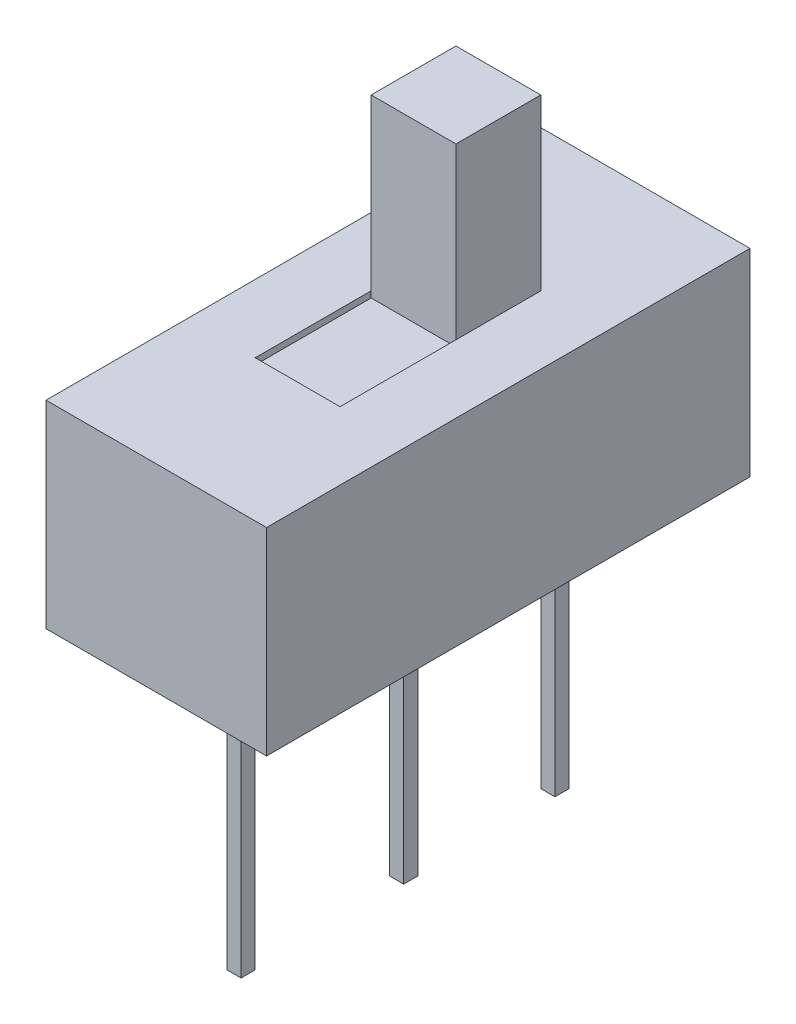
ISO-10303-21;
HEADER;
FILE_DESCRIPTION(('STEP AP214'),'2;1');
FILE_NAME('part.step','',(''),(''),'','','');
FILE_SCHEMA(('AUTOMOTIVE_DESIGN { 1 0 10303 214 1 1 1 1 }'));
ENDSEC;
DATA;
#1=APPLICATION_CONTEXT('core data for automotive mechanical design processes');
#2=APPLICATION_PROTOCOL_DEFINITION('international standard','automotive_design',2000,#1);
#3=PRODUCT_CONTEXT('',#1,'mechanical');
#4=PRODUCT('Part','Part','',(#3));
#5=PRODUCT_RELATED_PRODUCT_CATEGORY('part','',(#4));
#6=PRODUCT_DEFINITION_FORMATION('','',#4);
#7=PRODUCT_DEFINITION_CONTEXT('part definition',#1,'design');
#8=PRODUCT_DEFINITION('design','',#6,#7);
#9=PRODUCT_DEFINITION_SHAPE('','',#8);
#10=(LENGTH_UNIT() NAMED_UNIT(*) SI_UNIT(.MILLI.,.METRE.));
#11=(NAMED_UNIT(*) PLANE_ANGLE_UNIT() SI_UNIT($,.RADIAN.));
#12=(NAMED_UNIT(*) SI_UNIT($,.STERADIAN.) SOLID_ANGLE_UNIT());
#13=UNCERTAINTY_MEASURE_WITH_UNIT(LENGTH_MEASURE(1.E-05),#10,'distance_accuracy_value','');
#14=(GEOMETRIC_REPRESENTATION_CONTEXT(3) GLOBAL_UNCERTAINTY_ASSIGNED_CONTEXT((#13)) GLOBAL_UNIT_ASSIGNED_CONTEXT((#10,
#11,#12)) REPRESENTATION_CONTEXT('',''));
#15=CARTESIAN_POINT('',(0.,0.,0.));
#16=DIRECTION('',(0.,0.,1.));
#17=DIRECTION('',(1.,0.,0.));
#18=AXIS2_PLACEMENT_3D('',#15,#16,#17);
#19=CARTESIAN_POINT('',(0.,0.,0.));
#20=DIRECTION('',(0.,1.,0.));
#21=DIRECTION('',(0.,0.,1.));
#22=AXIS2_PLACEMENT_3D('',#19,#20,#21);
#23=PLANE('',#22);
#24=DIRECTION('',(-1.,0.,0.));
#25=VECTOR('',#24,1.);
#26=CARTESIAN_POINT('',(1.825,0.,-1.375));
#27=LINE('',#26,#25);
#28=CARTESIAN_POINT('',(2.075,0.,-1.375));
#29=VERTEX_POINT('',#28);
#30=CARTESIAN_POINT('',(1.825,0.,-1.375));
#31=VERTEX_POINT('',#30);
#32=EDGE_CURVE('E214',#29,#31,#27,.T.);
#33=ORIENTED_EDGE('',*,*,#32,.F.);
#34=DIRECTION('',(0.,0.,1.));
#35=VECTOR('',#34,1.);
#36=CARTESIAN_POINT('',(2.075,0.,-1.375));
#37=LINE('',#36,#35);
#38=CARTESIAN_POINT('',(2.075,0.,-1.625));
#39=VERTEX_POINT('',#38);
#40=EDGE_CURVE('E227',#39,#29,#37,.T.);
#41=ORIENTED_EDGE('',*,*,#40,.F.);
#42=DIRECTION('',(1.,0.,0.));
#43=VECTOR('',#42,1.);
#44=CARTESIAN_POINT('',(2.075,0.,-1.625));
#45=LINE('',#44,#43);
#46=CARTESIAN_POINT('',(1.825,0.,-1.625));
#47=VERTEX_POINT('',#46);
#48=EDGE_CURVE('E236',#47,#39,#45,.T.);
#49=ORIENTED_EDGE('',*,*,#48,.F.);
#50=DIRECTION('',(0.,0.,-1.));
#51=VECTOR('',#50,1.);
#52=CARTESIAN_POINT('',(1.825,0.,-1.625));
#53=LINE('',#52,#51);
#54=EDGE_CURVE('E217',#31,#47,#53,.T.);
#55=ORIENTED_EDGE('',*,*,#54,.F.);
#56=EDGE_LOOP('',(#33,#41,#49,#55));
#57=FACE_BOUND('',#56,.T.);
#58=DIRECTION('',(0.,0.,-1.));
#59=VECTOR('',#58,1.);
#60=CARTESIAN_POINT('',(3.9,0.,0.));
#61=LINE('',#60,#59);
#62=CARTESIAN_POINT('',(3.9,0.,0.));
#63=VERTEX_POINT('',#62);
#64=CARTESIAN_POINT('',(3.9,0.,-8.55));
#65=VERTEX_POINT('',#64);
#66=EDGE_CURVE('E343',#63,#65,#61,.T.);
#67=ORIENTED_EDGE('',*,*,#66,.F.);
#68=DIRECTION('',(1.,0.,0.));
#69=VECTOR('',#68,1.);
#70=CARTESIAN_POINT('',(0.,0.,0.));
#71=LINE('',#70,#69);
#72=CARTESIAN_POINT('',(0.,0.,0.));
#73=VERTEX_POINT('',#72);
#74=EDGE_CURVE('E353',#73,#63,#71,.T.);
#75=ORIENTED_EDGE('',*,*,#74,.F.);
#76=DIRECTION('',(0.,0.,1.));
#77=VECTOR('',#76,1.);
#78=CARTESIAN_POINT('',(0.,0.,-8.55));
#79=LINE('',#78,#77);
#80=CARTESIAN_POINT('',(0.,0.,-8.55));
#81=VERTEX_POINT('',#80);
#82=EDGE_CURVE('E350',#81,#73,#79,.T.);
#83=ORIENTED_EDGE('',*,*,#82,.F.);
#84=DIRECTION('',(-1.,0.,0.));
#85=VECTOR('',#84,1.);
#86=CARTESIAN_POINT('',(3.9,0.,-8.55));
#87=LINE('',#86,#85);
#88=EDGE_CURVE('E346',#65,#81,#87,.T.);
#89=ORIENTED_EDGE('',*,*,#88,.F.);
#90=EDGE_LOOP('',(#67,#75,#83,#89));
#91=FACE_BOUND('',#90,.T.);
#92=DIRECTION('',(-1.,0.,0.));
#93=VECTOR('',#92,1.);
#94=CARTESIAN_POINT('',(1.825,0.,-6.925));
#95=LINE('',#94,#93);
#96=CARTESIAN_POINT('',(2.075,0.,-6.925));
#97=VERTEX_POINT('',#96);
#98=CARTESIAN_POINT('',(1.825,0.,-6.925));
#99=VERTEX_POINT('',#98);
#100=EDGE_CURVE('E252',#97,#99,#95,.T.);
#101=ORIENTED_EDGE('',*,*,#100,.F.);
#102=DIRECTION('',(0.,0.,1.));
#103=VECTOR('',#102,1.);
#104=CARTESIAN_POINT('',(2.075,0.,-6.925));
#105=LINE('',#104,#103);
#106=CARTESIAN_POINT('',(2.075,0.,-7.175));
#107=VERTEX_POINT('',#106);
#108=EDGE_CURVE('E257',#107,#97,#105,.T.);
#109=ORIENTED_EDGE('',*,*,#108,.F.);
#110=DIRECTION('',(1.,0.,0.));
#111=VECTOR('',#110,1.);
#112=CARTESIAN_POINT('',(2.075,0.,-7.175));
#113=LINE('',#112,#111);
#114=CARTESIAN_POINT('',(1.825,0.,-7.175));
#115=VERTEX_POINT('',#114);
#116=EDGE_CURVE('E269',#115,#107,#113,.T.);
#117=ORIENTED_EDGE('',*,*,#116,.F.);
#118=DIRECTION('',(0.,0.,-1.));
#119=VECTOR('',#118,1.);
#120=CARTESIAN_POINT('',(1.825,0.,-7.175));
#121=LINE('',#120,#119);
#122=EDGE_CURVE('E266',#99,#115,#121,.T.);
#123=ORIENTED_EDGE('',*,*,#122,.F.);
#124=EDGE_LOOP('',(#101,#109,#117,#123));
#125=FACE_BOUND('',#124,.T.);
#126=DIRECTION('',(-1.,0.,0.));
#127=VECTOR('',#126,1.);
#128=CARTESIAN_POINT('',(1.825,0.,-4.25));
#129=LINE('',#128,#127);
#130=CARTESIAN_POINT('',(2.075,0.,-4.25));
#131=VERTEX_POINT('',#130);
#132=CARTESIAN_POINT('',(1.825,0.,-4.25));
#133=VERTEX_POINT('',#132);
#134=EDGE_CURVE('E213',#131,#133,#129,.T.);
#135=ORIENTED_EDGE('',*,*,#134,.F.);
#136=DIRECTION('',(0.,0.,1.));
#137=VECTOR('',#136,1.);
#138=CARTESIAN_POINT('',(2.075,0.,-4.25));
#139=LINE('',#138,#137);
#140=CARTESIAN_POINT('',(2.075,0.,-4.5));
#141=VERTEX_POINT('',#140);
#142=EDGE_CURVE('E210',#141,#131,#139,.T.);
#143=ORIENTED_EDGE('',*,*,#142,.F.);
#144=DIRECTION('',(1.,0.,0.));
#145=VECTOR('',#144,1.);
#146=CARTESIAN_POINT('',(2.075,0.,-4.5));
#147=LINE('',#146,#145);
#148=CARTESIAN_POINT('',(1.825,0.,-4.5));
#149=VERTEX_POINT('',#148);
#150=EDGE_CURVE('E59',#149,#141,#147,.T.);
#151=ORIENTED_EDGE('',*,*,#150,.F.);
#152=DIRECTION('',(0.,0.,-1.));
#153=VECTOR('',#152,1.);
#154=CARTESIAN_POINT('',(1.825,0.,-4.5));
#155=LINE('',#154,#153);
#156=EDGE_CURVE('E54',#133,#149,#155,.T.);
#157=ORIENTED_EDGE('',*,*,#156,.F.);
#158=EDGE_LOOP('',(#135,#143,#151,#157));
#159=FACE_BOUND('',#158,.T.);
#160=ADVANCED_FACE('F37',(#57,#91,#125,#159),#23,.F.);
#161=CARTESIAN_POINT('',(0.,3.5,0.));
#162=DIRECTION('',(0.,1.,0.));
#163=DIRECTION('',(0.,0.,1.));
#164=AXIS2_PLACEMENT_3D('',#161,#162,#163);
#165=PLANE('',#164);
#166=DIRECTION('',(0.,0.,-1.));
#167=VECTOR('',#166,1.);
#168=CARTESIAN_POINT('',(3.9,3.5,0.));
#169=LINE('',#168,#167);
#170=CARTESIAN_POINT('',(3.9,3.5,0.));
#171=VERTEX_POINT('',#170);
#172=CARTESIAN_POINT('',(3.9,3.5,-8.55));
#173=VERTEX_POINT('',#172);
#174=EDGE_CURVE('E339',#171,#173,#169,.T.);
#175=ORIENTED_EDGE('',*,*,#174,.T.);
#176=DIRECTION('',(-1.,0.,0.));
#177=VECTOR('',#176,1.);
#178=CARTESIAN_POINT('',(3.9,3.5,-8.55));
#179=LINE('',#178,#177);
#180=CARTESIAN_POINT('',(0.,3.5,-8.55));
#181=VERTEX_POINT('',#180);
#182=EDGE_CURVE('E358',#173,#181,#179,.T.);
#183=ORIENTED_EDGE('',*,*,#182,.T.);
#184=DIRECTION('',(0.,0.,1.));
#185=VECTOR('',#184,1.);
#186=CARTESIAN_POINT('',(0.,3.5,-8.55));
#187=LINE('',#186,#185);
#188=CARTESIAN_POINT('',(0.,3.5,0.));
#189=VERTEX_POINT('',#188);
#190=EDGE_CURVE('E361',#181,#189,#187,.T.);
#191=ORIENTED_EDGE('',*,*,#190,.T.);
#192=DIRECTION('',(1.,0.,0.));
#193=VECTOR('',#192,1.);
#194=CARTESIAN_POINT('',(0.,3.5,0.));
#195=LINE('',#194,#193);
#196=EDGE_CURVE('E347',#189,#171,#195,.T.);
#197=ORIENTED_EDGE('',*,*,#196,.T.);
#198=EDGE_LOOP('',(#175,#183,#191,#197));
#199=FACE_BOUND('',#198,.T.);
#200=DIRECTION('',(1.,0.,0.));
#201=VECTOR('',#200,1.);
#202=CARTESIAN_POINT('',(1.2,3.5,-2.5));
#203=LINE('',#202,#201);
#204=CARTESIAN_POINT('',(1.2,3.5,-2.5));
#205=VERTEX_POINT('',#204);
#206=CARTESIAN_POINT('',(2.7,3.5,-2.5));
#207=VERTEX_POINT('',#206);
#208=EDGE_CURVE('E298',#205,#207,#203,.T.);
#209=ORIENTED_EDGE('',*,*,#208,.F.);
#210=DIRECTION('',(0.,0.,1.));
#211=VECTOR('',#210,1.);
#212=CARTESIAN_POINT('',(1.2,3.5,-4.55));
#213=LINE('',#212,#211);
#214=CARTESIAN_POINT('',(1.2,3.5,-4.55));
#215=VERTEX_POINT('',#214);
#216=EDGE_CURVE('E288',#215,#205,#213,.T.);
#217=ORIENTED_EDGE('',*,*,#216,.F.);
#218=DIRECTION('',(0.,0.,-1.));
#219=VECTOR('',#218,1.);
#220=CARTESIAN_POINT('',(1.2,3.5,-4.55));
#221=LINE('',#220,#219);
#222=CARTESIAN_POINT('',(1.2,3.5,-6.05));
#223=VERTEX_POINT('',#222);
#224=EDGE_CURVE('E324',#215,#223,#221,.T.);
#225=ORIENTED_EDGE('',*,*,#224,.T.);
#226=DIRECTION('',(1.,0.,0.));
#227=VECTOR('',#226,1.);
#228=CARTESIAN_POINT('',(1.2,3.5,-6.05));
#229=LINE('',#228,#227);
#230=CARTESIAN_POINT('',(2.7,3.5,-6.05));
#231=VERTEX_POINT('',#230);
#232=EDGE_CURVE('E337',#223,#231,#229,.T.);
#233=ORIENTED_EDGE('',*,*,#232,.T.);
#234=DIRECTION('',(0.,0.,-1.));
#235=VECTOR('',#234,1.);
#236=CARTESIAN_POINT('',(2.7,3.5,-4.55));
#237=LINE('',#236,#235);
#238=CARTESIAN_POINT('',(2.7,3.5,-4.55));
#239=VERTEX_POINT('',#238);
#240=EDGE_CURVE('E318',#239,#231,#237,.T.);
#241=ORIENTED_EDGE('',*,*,#240,.F.);
#242=DIRECTION('',(0.,0.,1.));
#243=VECTOR('',#242,1.);
#244=CARTESIAN_POINT('',(2.7,3.5,-4.55));
#245=LINE('',#244,#243);
#246=EDGE_CURVE('E300',#239,#207,#245,.T.);
#247=ORIENTED_EDGE('',*,*,#246,.T.);
#248=EDGE_LOOP('',(#209,#217,#225,#233,#241,#247));
#249=FACE_BOUND('',#248,.T.);
#250=ADVANCED_FACE('F376',(#199,#249),#165,.T.);
#251=CARTESIAN_POINT('',(3.9,0.,0.));
#252=DIRECTION('',(1.,0.,0.));
#253=DIRECTION('',(0.,0.,-1.));
#254=AXIS2_PLACEMENT_3D('',#251,#252,#253);
#255=PLANE('',#254);
#256=ORIENTED_EDGE('',*,*,#174,.F.);
#257=DIRECTION('',(0.,1.,0.));
#258=VECTOR('',#257,1.);
#259=CARTESIAN_POINT('',(3.9,0.,0.));
#260=LINE('',#259,#258);
#261=EDGE_CURVE('E11',#63,#171,#260,.T.);
#262=ORIENTED_EDGE('',*,*,#261,.F.);
#263=ORIENTED_EDGE('',*,*,#66,.T.);
#264=DIRECTION('',(0.,1.,0.));
#265=VECTOR('',#264,1.);
#266=CARTESIAN_POINT('',(3.9,0.,-8.55));
#267=LINE('',#266,#265);
#268=EDGE_CURVE('E41',#65,#173,#267,.T.);
#269=ORIENTED_EDGE('',*,*,#268,.T.);
#270=EDGE_LOOP('',(#256,#262,#263,#269));
#271=FACE_BOUND('',#270,.T.);
#272=ADVANCED_FACE('F39',(#271),#255,.T.);
#273=CARTESIAN_POINT('',(0.,0.,0.));
#274=DIRECTION('',(0.,0.,1.));
#275=DIRECTION('',(1.,0.,0.));
#276=AXIS2_PLACEMENT_3D('',#273,#274,#275);
#277=PLANE('',#276);
#278=ORIENTED_EDGE('',*,*,#196,.F.);
#279=DIRECTION('',(0.,1.,0.));
#280=VECTOR('',#279,1.);
#281=CARTESIAN_POINT('',(0.,0.,0.));
#282=LINE('',#281,#280);
#283=EDGE_CURVE('E46',#73,#189,#282,.T.);
#284=ORIENTED_EDGE('',*,*,#283,.F.);
#285=ORIENTED_EDGE('',*,*,#74,.T.);
#286=ORIENTED_EDGE('',*,*,#261,.T.);
#287=EDGE_LOOP('',(#278,#284,#285,#286));
#288=FACE_BOUND('',#287,.T.);
#289=ADVANCED_FACE('F380',(#288),#277,.T.);
#290=CARTESIAN_POINT('',(0.,0.,-8.55));
#291=DIRECTION('',(-1.,0.,0.));
#292=DIRECTION('',(0.,0.,1.));
#293=AXIS2_PLACEMENT_3D('',#290,#291,#292);
#294=PLANE('',#293);
#295=ORIENTED_EDGE('',*,*,#190,.F.);
#296=DIRECTION('',(0.,1.,0.));
#297=VECTOR('',#296,1.);
#298=CARTESIAN_POINT('',(0.,0.,-8.55));
#299=LINE('',#298,#297);
#300=EDGE_CURVE('E366',#81,#181,#299,.T.);
#301=ORIENTED_EDGE('',*,*,#300,.F.);
#302=ORIENTED_EDGE('',*,*,#82,.T.);
#303=ORIENTED_EDGE('',*,*,#283,.T.);
#304=EDGE_LOOP('',(#295,#301,#302,#303));
#305=FACE_BOUND('',#304,.T.);
#306=ADVANCED_FACE('F386',(#305),#294,.T.);
#307=CARTESIAN_POINT('',(3.9,0.,-8.55));
#308=DIRECTION('',(0.,0.,-1.));
#309=DIRECTION('',(-1.,0.,0.));
#310=AXIS2_PLACEMENT_3D('',#307,#308,#309);
#311=PLANE('',#310);
#312=ORIENTED_EDGE('',*,*,#182,.F.);
#313=ORIENTED_EDGE('',*,*,#268,.F.);
#314=ORIENTED_EDGE('',*,*,#88,.T.);
#315=ORIENTED_EDGE('',*,*,#300,.T.);
#316=EDGE_LOOP('',(#312,#313,#314,#315));
#317=FACE_BOUND('',#316,.T.);
#318=ADVANCED_FACE('F374',(#317),#311,.T.);
#319=CARTESIAN_POINT('',(1.2,3.5,-6.05));
#320=DIRECTION('',(0.,0.,-1.));
#321=DIRECTION('',(-1.,0.,0.));
#322=AXIS2_PLACEMENT_3D('',#319,#320,#321);
#323=PLANE('',#322);
#324=DIRECTION('',(0.,1.,0.));
#325=VECTOR('',#324,1.);
#326=CARTESIAN_POINT('',(2.7,3.5,-6.05));
#327=LINE('',#326,#325);
#328=CARTESIAN_POINT('',(2.7,6.5,-6.05));
#329=VERTEX_POINT('',#328);
#330=EDGE_CURVE('E310',#231,#329,#327,.T.);
#331=ORIENTED_EDGE('',*,*,#330,.F.);
#332=ORIENTED_EDGE('',*,*,#232,.F.);
#333=DIRECTION('',(0.,1.,0.));
#334=VECTOR('',#333,1.);
#335=CARTESIAN_POINT('',(1.2,3.5,-6.05));
#336=LINE('',#335,#334);
#337=CARTESIAN_POINT('',(1.2,6.5,-6.05));
#338=VERTEX_POINT('',#337);
#339=EDGE_CURVE('E314',#223,#338,#336,.T.);
#340=ORIENTED_EDGE('',*,*,#339,.T.);
#341=DIRECTION('',(1.,0.,0.));
#342=VECTOR('',#341,1.);
#343=CARTESIAN_POINT('',(1.2,6.5,-6.05));
#344=LINE('',#343,#342);
#345=EDGE_CURVE('E326',#338,#329,#344,.T.);
#346=ORIENTED_EDGE('',*,*,#345,.T.);
#347=EDGE_LOOP('',(#331,#332,#340,#346));
#348=FACE_BOUND('',#347,.T.);
#349=ADVANCED_FACE('F393',(#348),#323,.T.);
#350=CARTESIAN_POINT('',(1.2,6.5,-4.55));
#351=DIRECTION('',(0.,0.,1.));
#352=DIRECTION('',(1.,0.,0.));
#353=AXIS2_PLACEMENT_3D('',#350,#351,#352);
#354=PLANE('',#353);
#355=DIRECTION('',(0.,-1.,0.));
#356=VECTOR('',#355,1.);
#357=CARTESIAN_POINT('',(2.7,6.5,-4.55));
#358=LINE('',#357,#356);
#359=CARTESIAN_POINT('',(2.7,6.5,-4.55));
#360=VERTEX_POINT('',#359);
#361=EDGE_CURVE('E332',#360,#239,#358,.T.);
#362=ORIENTED_EDGE('',*,*,#361,.F.);
#363=DIRECTION('',(1.,0.,0.));
#364=VECTOR('',#363,1.);
#365=CARTESIAN_POINT('',(1.2,6.5,-4.55));
#366=LINE('',#365,#364);
#367=CARTESIAN_POINT('',(1.2,6.5,-4.55));
#368=VERTEX_POINT('',#367);
#369=EDGE_CURVE('E340',#368,#360,#366,.T.);
#370=ORIENTED_EDGE('',*,*,#369,.F.);
#371=DIRECTION('',(0.,-1.,0.));
#372=VECTOR('',#371,1.);
#373=CARTESIAN_POINT('',(1.2,6.5,-4.55));
#374=LINE('',#373,#372);
#375=EDGE_CURVE('E321',#368,#215,#374,.T.);
#376=ORIENTED_EDGE('',*,*,#375,.T.);
#377=DIRECTION('',(0.,1.,0.));
#378=VECTOR('',#377,1.);
#379=CARTESIAN_POINT('',(1.2,3.39,-4.55));
#380=LINE('',#379,#378);
#381=CARTESIAN_POINT('',(1.2,3.39,-4.55));
#382=VERTEX_POINT('',#381);
#383=EDGE_CURVE('E286',#382,#215,#380,.T.);
#384=ORIENTED_EDGE('',*,*,#383,.F.);
#385=DIRECTION('',(1.,0.,0.));
#386=VECTOR('',#385,1.);
#387=CARTESIAN_POINT('',(1.2,3.39,-4.55));
#388=LINE('',#387,#386);
#389=CARTESIAN_POINT('',(2.7,3.39,-4.55));
#390=VERTEX_POINT('',#389);
#391=EDGE_CURVE('E308',#382,#390,#388,.T.);
#392=ORIENTED_EDGE('',*,*,#391,.T.);
#393=DIRECTION('',(0.,1.,0.));
#394=VECTOR('',#393,1.);
#395=CARTESIAN_POINT('',(2.7,3.39,-4.55));
#396=LINE('',#395,#394);
#397=EDGE_CURVE('E285',#390,#239,#396,.T.);
#398=ORIENTED_EDGE('',*,*,#397,.T.);
#399=EDGE_LOOP('',(#362,#370,#376,#384,#392,#398));
#400=FACE_BOUND('',#399,.T.);
#401=ADVANCED_FACE('F405',(#400),#354,.T.);
#402=CARTESIAN_POINT('',(1.2,6.5,-6.05));
#403=DIRECTION('',(0.,1.,0.));
#404=DIRECTION('',(0.,0.,1.));
#405=AXIS2_PLACEMENT_3D('',#402,#403,#404);
#406=PLANE('',#405);
#407=DIRECTION('',(0.,0.,1.));
#408=VECTOR('',#407,1.);
#409=CARTESIAN_POINT('',(2.7,6.5,-6.05));
#410=LINE('',#409,#408);
#411=EDGE_CURVE('E329',#329,#360,#410,.T.);
#412=ORIENTED_EDGE('',*,*,#411,.F.);
#413=ORIENTED_EDGE('',*,*,#345,.F.);
#414=DIRECTION('',(0.,0.,1.));
#415=VECTOR('',#414,1.);
#416=CARTESIAN_POINT('',(1.2,6.5,-6.05));
#417=LINE('',#416,#415);
#418=EDGE_CURVE('E317',#338,#368,#417,.T.);
#419=ORIENTED_EDGE('',*,*,#418,.T.);
#420=ORIENTED_EDGE('',*,*,#369,.T.);
#421=EDGE_LOOP('',(#412,#413,#419,#420));
#422=FACE_BOUND('',#421,.T.);
#423=ADVANCED_FACE('F407',(#422),#406,.T.);
#424=CARTESIAN_POINT('',(1.2,0.,0.));
#425=DIRECTION('',(1.,0.,0.));
#426=DIRECTION('',(0.,0.,-1.));
#427=AXIS2_PLACEMENT_3D('',#424,#425,#426);
#428=PLANE('',#427);
#429=ORIENTED_EDGE('',*,*,#339,.F.);
#430=ORIENTED_EDGE('',*,*,#224,.F.);
#431=ORIENTED_EDGE('',*,*,#375,.F.);
#432=ORIENTED_EDGE('',*,*,#418,.F.);
#433=EDGE_LOOP('',(#429,#430,#431,#432));
#434=FACE_BOUND('',#433,.T.);
#435=ADVANCED_FACE('F410',(#434),#428,.F.);
#436=CARTESIAN_POINT('',(2.7,0.,0.));
#437=DIRECTION('',(1.,0.,0.));
#438=DIRECTION('',(0.,0.,-1.));
#439=AXIS2_PLACEMENT_3D('',#436,#437,#438);
#440=PLANE('',#439);
#441=ORIENTED_EDGE('',*,*,#330,.T.);
#442=ORIENTED_EDGE('',*,*,#411,.T.);
#443=ORIENTED_EDGE('',*,*,#361,.T.);
#444=ORIENTED_EDGE('',*,*,#240,.T.);
#445=EDGE_LOOP('',(#441,#442,#443,#444));
#446=FACE_BOUND('',#445,.T.);
#447=ADVANCED_FACE('F415',(#446),#440,.T.);
#448=CARTESIAN_POINT('',(1.2,3.39,-2.5));
#449=DIRECTION('',(0.,-1.,0.));
#450=DIRECTION('',(0.,0.,-1.));
#451=AXIS2_PLACEMENT_3D('',#448,#449,#450);
#452=PLANE('',#451);
#453=DIRECTION('',(0.,0.,-1.));
#454=VECTOR('',#453,1.);
#455=CARTESIAN_POINT('',(2.7,3.39,-2.5));
#456=LINE('',#455,#454);
#457=CARTESIAN_POINT('',(2.7,3.39,-2.5));
#458=VERTEX_POINT('',#457);
#459=EDGE_CURVE('E289',#458,#390,#456,.T.);
#460=ORIENTED_EDGE('',*,*,#459,.T.);
#461=ORIENTED_EDGE('',*,*,#391,.F.);
#462=DIRECTION('',(0.,0.,-1.));
#463=VECTOR('',#462,1.);
#464=CARTESIAN_POINT('',(1.2,3.39,-2.5));
#465=LINE('',#464,#463);
#466=CARTESIAN_POINT('',(1.2,3.39,-2.5));
#467=VERTEX_POINT('',#466);
#468=EDGE_CURVE('E295',#467,#382,#465,.T.);
#469=ORIENTED_EDGE('',*,*,#468,.F.);
#470=DIRECTION('',(1.,0.,0.));
#471=VECTOR('',#470,1.);
#472=CARTESIAN_POINT('',(1.2,3.39,-2.5));
#473=LINE('',#472,#471);
#474=EDGE_CURVE('E311',#467,#458,#473,.T.);
#475=ORIENTED_EDGE('',*,*,#474,.T.);
#476=EDGE_LOOP('',(#460,#461,#469,#475));
#477=FACE_BOUND('',#476,.T.);
#478=ADVANCED_FACE('F418',(#477),#452,.F.);
#479=CARTESIAN_POINT('',(1.2,3.5,-2.5));
#480=DIRECTION('',(0.,0.,1.));
#481=DIRECTION('',(1.,0.,0.));
#482=AXIS2_PLACEMENT_3D('',#479,#480,#481);
#483=PLANE('',#482);
#484=DIRECTION('',(0.,-1.,0.));
#485=VECTOR('',#484,1.);
#486=CARTESIAN_POINT('',(2.7,3.5,-2.5));
#487=LINE('',#486,#485);
#488=EDGE_CURVE('E303',#207,#458,#487,.T.);
#489=ORIENTED_EDGE('',*,*,#488,.T.);
#490=ORIENTED_EDGE('',*,*,#474,.F.);
#491=DIRECTION('',(0.,-1.,0.));
#492=VECTOR('',#491,1.);
#493=CARTESIAN_POINT('',(1.2,3.5,-2.5));
#494=LINE('',#493,#492);
#495=EDGE_CURVE('E292',#205,#467,#494,.T.);
#496=ORIENTED_EDGE('',*,*,#495,.F.);
#497=ORIENTED_EDGE('',*,*,#208,.T.);
#498=EDGE_LOOP('',(#489,#490,#496,#497));
#499=FACE_BOUND('',#498,.T.);
#500=ADVANCED_FACE('F423',(#499),#483,.F.);
#501=CARTESIAN_POINT('',(1.2,0.,0.));
#502=DIRECTION('',(1.,0.,0.));
#503=DIRECTION('',(0.,0.,-1.));
#504=AXIS2_PLACEMENT_3D('',#501,#502,#503);
#505=PLANE('',#504);
#506=ORIENTED_EDGE('',*,*,#383,.T.);
#507=ORIENTED_EDGE('',*,*,#216,.T.);
#508=ORIENTED_EDGE('',*,*,#495,.T.);
#509=ORIENTED_EDGE('',*,*,#468,.T.);
#510=EDGE_LOOP('',(#506,#507,#508,#509));
#511=FACE_BOUND('',#510,.T.);
#512=ADVANCED_FACE('F426',(#511),#505,.T.);
#513=CARTESIAN_POINT('',(2.7,0.,0.));
#514=DIRECTION('',(1.,0.,0.));
#515=DIRECTION('',(0.,0.,-1.));
#516=AXIS2_PLACEMENT_3D('',#513,#514,#515);
#517=PLANE('',#516);
#518=ORIENTED_EDGE('',*,*,#397,.F.);
#519=ORIENTED_EDGE('',*,*,#459,.F.);
#520=ORIENTED_EDGE('',*,*,#488,.F.);
#521=ORIENTED_EDGE('',*,*,#246,.F.);
#522=EDGE_LOOP('',(#518,#519,#520,#521));
#523=FACE_BOUND('',#522,.T.);
#524=ADVANCED_FACE('F431',(#523),#517,.F.);
#525=CARTESIAN_POINT('',(1.825,-5.,-6.925));
#526=DIRECTION('',(0.,0.,-1.));
#527=DIRECTION('',(-1.,0.,0.));
#528=AXIS2_PLACEMENT_3D('',#525,#526,#527);
#529=PLANE('',#528);
#530=ORIENTED_EDGE('',*,*,#100,.T.);
#531=DIRECTION('',(0.,1.,0.));
#532=VECTOR('',#531,1.);
#533=CARTESIAN_POINT('',(1.825,-5.,-6.925));
#534=LINE('',#533,#532);
#535=CARTESIAN_POINT('',(1.825,-5.,-6.925));
#536=VERTEX_POINT('',#535);
#537=EDGE_CURVE('E282',#536,#99,#534,.T.);
#538=ORIENTED_EDGE('',*,*,#537,.F.);
#539=DIRECTION('',(-1.,0.,0.));
#540=VECTOR('',#539,1.);
#541=CARTESIAN_POINT('',(1.825,-5.,-6.925));
#542=LINE('',#541,#540);
#543=CARTESIAN_POINT('',(2.075,-5.,-6.925));
#544=VERTEX_POINT('',#543);
#545=EDGE_CURVE('E253',#544,#536,#542,.T.);
#546=ORIENTED_EDGE('',*,*,#545,.F.);
#547=DIRECTION('',(0.,1.,0.));
#548=VECTOR('',#547,1.);
#549=CARTESIAN_POINT('',(2.075,-5.,-6.925));
#550=LINE('',#549,#548);
#551=EDGE_CURVE('E263',#544,#97,#550,.T.);
#552=ORIENTED_EDGE('',*,*,#551,.T.);
#553=EDGE_LOOP('',(#530,#538,#546,#552));
#554=FACE_BOUND('',#553,.T.);
#555=ADVANCED_FACE('F434',(#554),#529,.F.);
#556=CARTESIAN_POINT('',(1.825,-5.,-7.175));
#557=DIRECTION('',(1.,0.,0.));
#558=DIRECTION('',(0.,0.,-1.));
#559=AXIS2_PLACEMENT_3D('',#556,#557,#558);
#560=PLANE('',#559);
#561=ORIENTED_EDGE('',*,*,#122,.T.);
#562=DIRECTION('',(0.,1.,0.));
#563=VECTOR('',#562,1.);
#564=CARTESIAN_POINT('',(1.825,-5.,-7.175));
#565=LINE('',#564,#563);
#566=CARTESIAN_POINT('',(1.825,-5.,-7.175));
#567=VERTEX_POINT('',#566);
#568=EDGE_CURVE('E279',#567,#115,#565,.T.);
#569=ORIENTED_EDGE('',*,*,#568,.F.);
#570=DIRECTION('',(0.,0.,-1.));
#571=VECTOR('',#570,1.);
#572=CARTESIAN_POINT('',(1.825,-5.,-7.175));
#573=LINE('',#572,#571);
#574=EDGE_CURVE('E256',#536,#567,#573,.T.);
#575=ORIENTED_EDGE('',*,*,#574,.F.);
#576=ORIENTED_EDGE('',*,*,#537,.T.);
#577=EDGE_LOOP('',(#561,#569,#575,#576));
#578=FACE_BOUND('',#577,.T.);
#579=ADVANCED_FACE('F441',(#578),#560,.F.);
#580=CARTESIAN_POINT('',(2.075,-5.,-7.175));
#581=DIRECTION('',(0.,0.,1.));
#582=DIRECTION('',(1.,0.,0.));
#583=AXIS2_PLACEMENT_3D('',#580,#581,#582);
#584=PLANE('',#583);
#585=ORIENTED_EDGE('',*,*,#116,.T.);
#586=DIRECTION('',(0.,1.,0.));
#587=VECTOR('',#586,1.);
#588=CARTESIAN_POINT('',(2.075,-5.,-7.175));
#589=LINE('',#588,#587);
#590=CARTESIAN_POINT('',(2.075,-5.,-7.175));
#591=VERTEX_POINT('',#590);
#592=EDGE_CURVE('E276',#591,#107,#589,.T.);
#593=ORIENTED_EDGE('',*,*,#592,.F.);
#594=DIRECTION('',(1.,0.,0.));
#595=VECTOR('',#594,1.);
#596=CARTESIAN_POINT('',(2.075,-5.,-7.175));
#597=LINE('',#596,#595);
#598=EDGE_CURVE('E259',#567,#591,#597,.T.);
#599=ORIENTED_EDGE('',*,*,#598,.F.);
#600=ORIENTED_EDGE('',*,*,#568,.T.);
#601=EDGE_LOOP('',(#585,#593,#599,#600));
#602=FACE_BOUND('',#601,.T.);
#603=ADVANCED_FACE('F445',(#602),#584,.F.);
#604=CARTESIAN_POINT('',(2.075,-5.,-6.925));
#605=DIRECTION('',(-1.,0.,0.));
#606=DIRECTION('',(0.,0.,1.));
#607=AXIS2_PLACEMENT_3D('',#604,#605,#606);
#608=PLANE('',#607);
#609=ORIENTED_EDGE('',*,*,#108,.T.);
#610=ORIENTED_EDGE('',*,*,#551,.F.);
#611=DIRECTION('',(0.,0.,1.));
#612=VECTOR('',#611,1.);
#613=CARTESIAN_POINT('',(2.075,-5.,-6.925));
#614=LINE('',#613,#612);
#615=EDGE_CURVE('E261',#591,#544,#614,.T.);
#616=ORIENTED_EDGE('',*,*,#615,.F.);
#617=ORIENTED_EDGE('',*,*,#592,.T.);
#618=EDGE_LOOP('',(#609,#610,#616,#617));
#619=FACE_BOUND('',#618,.T.);
#620=ADVANCED_FACE('F449',(#619),#608,.F.);
#621=CARTESIAN_POINT('',(0.,-5.,0.));
#622=DIRECTION('',(0.,1.,0.));
#623=DIRECTION('',(0.,0.,1.));
#624=AXIS2_PLACEMENT_3D('',#621,#622,#623);
#625=PLANE('',#624);
#626=ORIENTED_EDGE('',*,*,#545,.T.);
#627=ORIENTED_EDGE('',*,*,#574,.T.);
#628=ORIENTED_EDGE('',*,*,#598,.T.);
#629=ORIENTED_EDGE('',*,*,#615,.T.);
#630=EDGE_LOOP('',(#626,#627,#628,#629));
#631=FACE_BOUND('',#630,.T.);
#632=ADVANCED_FACE('F453',(#631),#625,.F.);
#633=CARTESIAN_POINT('',(1.825,-5.,-1.375));
#634=DIRECTION('',(0.,0.,-1.));
#635=DIRECTION('',(-1.,0.,0.));
#636=AXIS2_PLACEMENT_3D('',#633,#634,#635);
#637=PLANE('',#636);
#638=ORIENTED_EDGE('',*,*,#32,.T.);
#639=DIRECTION('',(0.,1.,0.));
#640=VECTOR('',#639,1.);
#641=CARTESIAN_POINT('',(1.825,-5.,-1.375));
#642=LINE('',#641,#640);
#643=CARTESIAN_POINT('',(1.825,-5.,-1.375));
#644=VERTEX_POINT('',#643);
#645=EDGE_CURVE('E249',#644,#31,#642,.T.);
#646=ORIENTED_EDGE('',*,*,#645,.F.);
#647=DIRECTION('',(-1.,0.,0.));
#648=VECTOR('',#647,1.);
#649=CARTESIAN_POINT('',(1.825,-5.,-1.375));
#650=LINE('',#649,#648);
#651=CARTESIAN_POINT('',(2.075,-5.,-1.375));
#652=VERTEX_POINT('',#651);
#653=EDGE_CURVE('E223',#652,#644,#650,.T.);
#654=ORIENTED_EDGE('',*,*,#653,.F.);
#655=DIRECTION('',(0.,1.,0.));
#656=VECTOR('',#655,1.);
#657=CARTESIAN_POINT('',(2.075,-5.,-1.375));
#658=LINE('',#657,#656);
#659=EDGE_CURVE('E232',#652,#29,#658,.T.);
#660=ORIENTED_EDGE('',*,*,#659,.T.);
#661=EDGE_LOOP('',(#638,#646,#654,#660));
#662=FACE_BOUND('',#661,.T.);
#663=ADVANCED_FACE('F457',(#662),#637,.F.);
#664=CARTESIAN_POINT('',(1.825,-5.,-1.625));
#665=DIRECTION('',(1.,0.,0.));
#666=DIRECTION('',(0.,0.,-1.));
#667=AXIS2_PLACEMENT_3D('',#664,#665,#666);
#668=PLANE('',#667);
#669=ORIENTED_EDGE('',*,*,#54,.T.);
#670=DIRECTION('',(0.,1.,0.));
#671=VECTOR('',#670,1.);
#672=CARTESIAN_POINT('',(1.825,-5.,-1.625));
#673=LINE('',#672,#671);
#674=CARTESIAN_POINT('',(1.825,-5.,-1.625));
#675=VERTEX_POINT('',#674);
#676=EDGE_CURVE('E246',#675,#47,#673,.T.);
#677=ORIENTED_EDGE('',*,*,#676,.F.);
#678=DIRECTION('',(0.,0.,-1.));
#679=VECTOR('',#678,1.);
#680=CARTESIAN_POINT('',(1.825,-5.,-1.625));
#681=LINE('',#680,#679);
#682=EDGE_CURVE('E226',#644,#675,#681,.T.);
#683=ORIENTED_EDGE('',*,*,#682,.F.);
#684=ORIENTED_EDGE('',*,*,#645,.T.);
#685=EDGE_LOOP('',(#669,#677,#683,#684));
#686=FACE_BOUND('',#685,.T.);
#687=ADVANCED_FACE('F461',(#686),#668,.F.);
#688=CARTESIAN_POINT('',(2.075,-5.,-1.625));
#689=DIRECTION('',(0.,0.,1.));
#690=DIRECTION('',(1.,0.,0.));
#691=AXIS2_PLACEMENT_3D('',#688,#689,#690);
#692=PLANE('',#691);
#693=ORIENTED_EDGE('',*,*,#48,.T.);
#694=DIRECTION('',(0.,1.,0.));
#695=VECTOR('',#694,1.);
#696=CARTESIAN_POINT('',(2.075,-5.,-1.625));
#697=LINE('',#696,#695);
#698=CARTESIAN_POINT('',(2.075,-5.,-1.625));
#699=VERTEX_POINT('',#698);
#700=EDGE_CURVE('E243',#699,#39,#697,.T.);
#701=ORIENTED_EDGE('',*,*,#700,.F.);
#702=DIRECTION('',(1.,0.,0.));
#703=VECTOR('',#702,1.);
#704=CARTESIAN_POINT('',(2.075,-5.,-1.625));
#705=LINE('',#704,#703);
#706=EDGE_CURVE('E229',#675,#699,#705,.T.);
#707=ORIENTED_EDGE('',*,*,#706,.F.);
#708=ORIENTED_EDGE('',*,*,#676,.T.);
#709=EDGE_LOOP('',(#693,#701,#707,#708));
#710=FACE_BOUND('',#709,.T.);
#711=ADVANCED_FACE('F465',(#710),#692,.F.);
#712=CARTESIAN_POINT('',(2.075,-5.,-1.375));
#713=DIRECTION('',(-1.,0.,0.));
#714=DIRECTION('',(0.,0.,1.));
#715=AXIS2_PLACEMENT_3D('',#712,#713,#714);
#716=PLANE('',#715);
#717=ORIENTED_EDGE('',*,*,#40,.T.);
#718=ORIENTED_EDGE('',*,*,#659,.F.);
#719=DIRECTION('',(0.,0.,1.));
#720=VECTOR('',#719,1.);
#721=CARTESIAN_POINT('',(2.075,-5.,-1.375));
#722=LINE('',#721,#720);
#723=EDGE_CURVE('E231',#699,#652,#722,.T.);
#724=ORIENTED_EDGE('',*,*,#723,.F.);
#725=ORIENTED_EDGE('',*,*,#700,.T.);
#726=EDGE_LOOP('',(#717,#718,#724,#725));
#727=FACE_BOUND('',#726,.T.);
#728=ADVANCED_FACE('F469',(#727),#716,.F.);
#729=CARTESIAN_POINT('',(0.,-5.,0.));
#730=DIRECTION('',(0.,1.,0.));
#731=DIRECTION('',(0.,0.,1.));
#732=AXIS2_PLACEMENT_3D('',#729,#730,#731);
#733=PLANE('',#732);
#734=ORIENTED_EDGE('',*,*,#653,.T.);
#735=ORIENTED_EDGE('',*,*,#682,.T.);
#736=ORIENTED_EDGE('',*,*,#706,.T.);
#737=ORIENTED_EDGE('',*,*,#723,.T.);
#738=EDGE_LOOP('',(#734,#735,#736,#737));
#739=FACE_BOUND('',#738,.T.);
#740=ADVANCED_FACE('F473',(#739),#733,.F.);
#741=CARTESIAN_POINT('',(1.825,-5.,-4.25));
#742=DIRECTION('',(0.,0.,-1.));
#743=DIRECTION('',(-1.,0.,0.));
#744=AXIS2_PLACEMENT_3D('',#741,#742,#743);
#745=PLANE('',#744);
#746=ORIENTED_EDGE('',*,*,#134,.T.);
#747=DIRECTION('',(0.,1.,0.));
#748=VECTOR('',#747,1.);
#749=CARTESIAN_POINT('',(1.825,-5.,-4.25));
#750=LINE('',#749,#748);
#751=CARTESIAN_POINT('',(1.825,-5.,-4.25));
#752=VERTEX_POINT('',#751);
#753=EDGE_CURVE('E194',#752,#133,#750,.T.);
#754=ORIENTED_EDGE('',*,*,#753,.F.);
#755=DIRECTION('',(-1.,0.,0.));
#756=VECTOR('',#755,1.);
#757=CARTESIAN_POINT('',(1.825,-5.,-4.25));
#758=LINE('',#757,#756);
#759=CARTESIAN_POINT('',(2.075,-5.,-4.25));
#760=VERTEX_POINT('',#759);
#761=EDGE_CURVE('E201',#760,#752,#758,.T.);
#762=ORIENTED_EDGE('',*,*,#761,.F.);
#763=DIRECTION('',(0.,1.,0.));
#764=VECTOR('',#763,1.);
#765=CARTESIAN_POINT('',(2.075,-5.,-4.25));
#766=LINE('',#765,#764);
#767=EDGE_CURVE('E675',#760,#131,#766,.T.);
#768=ORIENTED_EDGE('',*,*,#767,.T.);
#769=EDGE_LOOP('',(#746,#754,#762,#768));
#770=FACE_BOUND('',#769,.T.);
#771=ADVANCED_FACE('F212',(#770),#745,.F.);
#772=CARTESIAN_POINT('',(1.825,-5.,-4.5));
#773=DIRECTION('',(1.,0.,0.));
#774=DIRECTION('',(0.,0.,-1.));
#775=AXIS2_PLACEMENT_3D('',#772,#773,#774);
#776=PLANE('',#775);
#777=ORIENTED_EDGE('',*,*,#156,.T.);
#778=DIRECTION('',(0.,1.,0.));
#779=VECTOR('',#778,1.);
#780=CARTESIAN_POINT('',(1.825,-5.,-4.5));
#781=LINE('',#780,#779);
#782=CARTESIAN_POINT('',(1.825,-5.,-4.5));
#783=VERTEX_POINT('',#782);
#784=EDGE_CURVE('E197',#783,#149,#781,.T.);
#785=ORIENTED_EDGE('',*,*,#784,.F.);
#786=DIRECTION('',(0.,0.,-1.));
#787=VECTOR('',#786,1.);
#788=CARTESIAN_POINT('',(1.825,-5.,-4.5));
#789=LINE('',#788,#787);
#790=EDGE_CURVE('E190',#752,#783,#789,.T.);
#791=ORIENTED_EDGE('',*,*,#790,.F.);
#792=ORIENTED_EDGE('',*,*,#753,.T.);
#793=EDGE_LOOP('',(#777,#785,#791,#792));
#794=FACE_BOUND('',#793,.T.);
#795=ADVANCED_FACE('F192',(#794),#776,.F.);
#796=CARTESIAN_POINT('',(2.075,-5.,-4.5));
#797=DIRECTION('',(0.,0.,1.));
#798=DIRECTION('',(1.,0.,0.));
#799=AXIS2_PLACEMENT_3D('',#796,#797,#798);
#800=PLANE('',#799);
#801=ORIENTED_EDGE('',*,*,#150,.T.);
#802=DIRECTION('',(0.,1.,0.));
#803=VECTOR('',#802,1.);
#804=CARTESIAN_POINT('',(2.075,-5.,-4.5));
#805=LINE('',#804,#803);
#806=CARTESIAN_POINT('',(2.075,-5.,-4.5));
#807=VERTEX_POINT('',#806);
#808=EDGE_CURVE('E219',#807,#141,#805,.T.);
#809=ORIENTED_EDGE('',*,*,#808,.F.);
#810=DIRECTION('',(1.,0.,0.));
#811=VECTOR('',#810,1.);
#812=CARTESIAN_POINT('',(2.075,-5.,-4.5));
#813=LINE('',#812,#811);
#814=EDGE_CURVE('E200',#783,#807,#813,.T.);
#815=ORIENTED_EDGE('',*,*,#814,.F.);
#816=ORIENTED_EDGE('',*,*,#784,.T.);
#817=EDGE_LOOP('',(#801,#809,#815,#816));
#818=FACE_BOUND('',#817,.T.);
#819=ADVANCED_FACE('F482',(#818),#800,.F.);
#820=CARTESIAN_POINT('',(2.075,-5.,-4.25));
#821=DIRECTION('',(-1.,0.,0.));
#822=DIRECTION('',(0.,0.,1.));
#823=AXIS2_PLACEMENT_3D('',#820,#821,#822);
#824=PLANE('',#823);
#825=ORIENTED_EDGE('',*,*,#142,.T.);
#826=ORIENTED_EDGE('',*,*,#767,.F.);
#827=DIRECTION('',(0.,0.,1.));
#828=VECTOR('',#827,1.);
#829=CARTESIAN_POINT('',(2.075,-5.,-4.25));
#830=LINE('',#829,#828);
#831=EDGE_CURVE('E206',#807,#760,#830,.T.);
#832=ORIENTED_EDGE('',*,*,#831,.F.);
#833=ORIENTED_EDGE('',*,*,#808,.T.);
#834=EDGE_LOOP('',(#825,#826,#832,#833));
#835=FACE_BOUND('',#834,.T.);
#836=ADVANCED_FACE('F485',(#835),#824,.F.);
#837=CARTESIAN_POINT('',(0.,-5.,0.));
#838=DIRECTION('',(0.,1.,0.));
#839=DIRECTION('',(0.,0.,1.));
#840=AXIS2_PLACEMENT_3D('',#837,#838,#839);
#841=PLANE('',#840);
#842=ORIENTED_EDGE('',*,*,#761,.T.);
#843=ORIENTED_EDGE('',*,*,#790,.T.);
#844=ORIENTED_EDGE('',*,*,#814,.T.);
#845=ORIENTED_EDGE('',*,*,#831,.T.);
#846=EDGE_LOOP('',(#842,#843,#844,#845));
#847=FACE_BOUND('',#846,.T.);
#848=ADVANCED_FACE('F204',(#847),#841,.F.);
#849=CLOSED_SHELL('',(#160,#250,#272,#289,#306,#318,#349,#401,#423,#435,#447,#478,#500,#512,
#524,#555,#579,#603,#620,#632,#663,#687,#711,#728,#740,#771,#795,#819,#836,#848));
#850=MANIFOLD_SOLID_BREP('B2',#849);
#851=ADVANCED_BREP_SHAPE_REPRESENTATION('',(#18,#850),#14);
#852=SHAPE_DEFINITION_REPRESENTATION(#9,#851);
ENDSEC;
END-ISO-10303-21;
